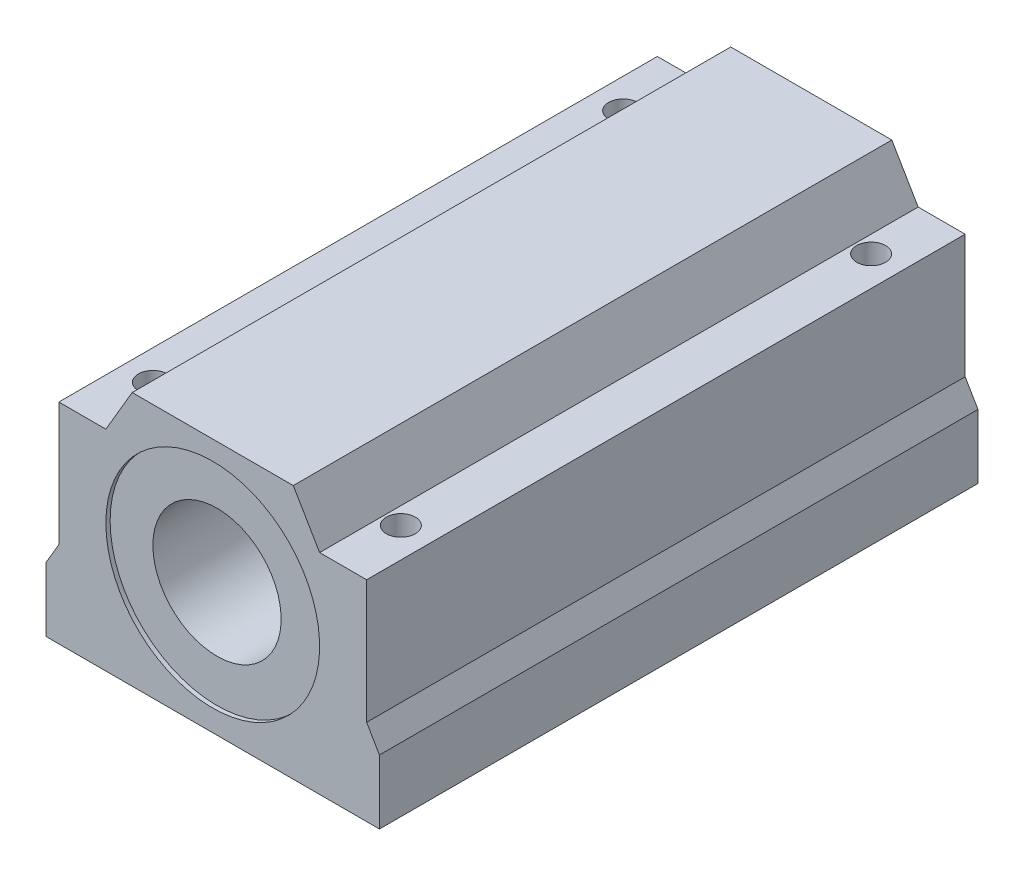
ISO-10303-21;
HEADER;
FILE_DESCRIPTION(('STEP AP214'),'2;1');
FILE_NAME('part.step','',(''),(''),'','','');
FILE_SCHEMA(('AUTOMOTIVE_DESIGN { 1 0 10303 214 1 1 1 1 }'));
ENDSEC;
DATA;
#1=APPLICATION_CONTEXT('core data for automotive mechanical design processes');
#2=APPLICATION_PROTOCOL_DEFINITION('international standard','automotive_design',2000,#1);
#3=PRODUCT_CONTEXT('',#1,'mechanical');
#4=PRODUCT('Part','Part','',(#3));
#5=PRODUCT_RELATED_PRODUCT_CATEGORY('part','',(#4));
#6=PRODUCT_DEFINITION_FORMATION('','',#4);
#7=PRODUCT_DEFINITION_CONTEXT('part definition',#1,'design');
#8=PRODUCT_DEFINITION('design','',#6,#7);
#9=PRODUCT_DEFINITION_SHAPE('','',#8);
#10=(LENGTH_UNIT() NAMED_UNIT(*) SI_UNIT(.MILLI.,.METRE.));
#11=(NAMED_UNIT(*) PLANE_ANGLE_UNIT() SI_UNIT($,.RADIAN.));
#12=(NAMED_UNIT(*) SI_UNIT($,.STERADIAN.) SOLID_ANGLE_UNIT());
#13=UNCERTAINTY_MEASURE_WITH_UNIT(LENGTH_MEASURE(1.E-05),#10,'distance_accuracy_value','');
#14=(GEOMETRIC_REPRESENTATION_CONTEXT(3) GLOBAL_UNCERTAINTY_ASSIGNED_CONTEXT((#13)) GLOBAL_UNIT_ASSIGNED_CONTEXT((#10,
#11,#12)) REPRESENTATION_CONTEXT('',''));
#15=CARTESIAN_POINT('',(0.,0.,0.));
#16=DIRECTION('',(0.,0.,1.));
#17=DIRECTION('',(1.,0.,0.));
#18=AXIS2_PLACEMENT_3D('',#15,#16,#17);
#19=CARTESIAN_POINT('',(0.,29.7500000000005,70.));
#20=DIRECTION('',(0.,0.,1.));
#21=DIRECTION('',(1.,0.,0.));
#22=AXIS2_PLACEMENT_3D('',#19,#20,#21);
#23=PLANE('',#22);
#24=CARTESIAN_POINT('',(0.,30.,70.));
#25=DIRECTION('',(0.,0.,-1.));
#26=DIRECTION('',(1.,0.,0.));
#27=AXIS2_PLACEMENT_3D('',#24,#25,#26);
#28=CIRCLE('',#27,25.);
#29=CARTESIAN_POINT('',(-25.,30.,70.));
#30=VERTEX_POINT('',#29);
#31=EDGE_CURVE('P0_E192',#30,#30,#28,.T.);
#32=ORIENTED_EDGE('',*,*,#31,.T.);
#33=EDGE_LOOP('',(#32));
#34=FACE_BOUND('',#33,.T.);
#35=DIRECTION('',(1.,0.,0.));
#36=VECTOR('',#35,1.);
#37=CARTESIAN_POINT('',(0.,0.,70.));
#38=LINE('',#37,#36);
#39=CARTESIAN_POINT('',(-39.,0.,70.));
#40=VERTEX_POINT('',#39);
#41=CARTESIAN_POINT('',(39.,0.,70.));
#42=VERTEX_POINT('',#41);
#43=EDGE_CURVE('P0_E11',#40,#42,#38,.T.);
#44=ORIENTED_EDGE('',*,*,#43,.T.);
#45=DIRECTION('',(0.,1.,0.));
#46=VECTOR('',#45,1.);
#47=CARTESIAN_POINT('',(39.,0.,70.));
#48=LINE('',#47,#46);
#49=CARTESIAN_POINT('',(39.,15.,70.));
#50=VERTEX_POINT('',#49);
#51=EDGE_CURVE('P0_E261',#42,#50,#48,.T.);
#52=ORIENTED_EDGE('',*,*,#51,.T.);
#53=DIRECTION('',(-0.505858736644665,0.862616333348879,0.));
#54=VECTOR('',#53,1.);
#55=CARTESIAN_POINT('',(36.,20.1157542858934,70.));
#56=LINE('',#55,#54);
#57=CARTESIAN_POINT('',(36.,20.1157542858934,70.));
#58=VERTEX_POINT('',#57);
#59=EDGE_CURVE('P0_E282',#50,#58,#56,.T.);
#60=ORIENTED_EDGE('',*,*,#59,.T.);
#61=DIRECTION('',(0.,1.,0.));
#62=VECTOR('',#61,1.);
#63=CARTESIAN_POINT('',(36.,20.1157542858934,70.));
#64=LINE('',#63,#62);
#65=CARTESIAN_POINT('',(36.,49.,70.));
#66=VERTEX_POINT('',#65);
#67=EDGE_CURVE('P0_E230',#58,#66,#64,.T.);
#68=ORIENTED_EDGE('',*,*,#67,.T.);
#69=DIRECTION('',(-1.,0.,0.));
#70=VECTOR('',#69,1.);
#71=CARTESIAN_POINT('',(36.,49.,70.));
#72=LINE('',#71,#70);
#73=CARTESIAN_POINT('',(25.,49.,70.));
#74=VERTEX_POINT('',#73);
#75=EDGE_CURVE('P0_E335',#66,#74,#72,.T.);
#76=ORIENTED_EDGE('',*,*,#75,.T.);
#77=DIRECTION('',(-0.505858736644659,0.862616333348882,0.));
#78=VECTOR('',#77,1.);
#79=CARTESIAN_POINT('',(18.8425502399788,59.5000000000011,70.));
#80=LINE('',#79,#78);
#81=CARTESIAN_POINT('',(18.8425502399788,59.5,70.));
#82=VERTEX_POINT('',#81);
#83=EDGE_CURVE('P0_E344',#74,#82,#80,.T.);
#84=ORIENTED_EDGE('',*,*,#83,.T.);
#85=DIRECTION('',(-1.,0.,0.));
#86=VECTOR('',#85,1.);
#87=CARTESIAN_POINT('',(0.,59.5,70.));
#88=LINE('',#87,#86);
#89=CARTESIAN_POINT('',(-18.8425502399788,59.5000000000009,70.));
#90=VERTEX_POINT('',#89);
#91=EDGE_CURVE('P0_E287',#82,#90,#88,.T.);
#92=ORIENTED_EDGE('',*,*,#91,.T.);
#93=DIRECTION('',(-0.505858736644664,-0.862616333348879,0.));
#94=VECTOR('',#93,1.);
#95=CARTESIAN_POINT('',(-25.,49.,70.));
#96=LINE('',#95,#94);
#97=CARTESIAN_POINT('',(-25.,49.,70.));
#98=VERTEX_POINT('',#97);
#99=EDGE_CURVE('P0_E275',#90,#98,#96,.T.);
#100=ORIENTED_EDGE('',*,*,#99,.T.);
#101=DIRECTION('',(-1.,0.,0.));
#102=VECTOR('',#101,1.);
#103=CARTESIAN_POINT('',(-36.,49.,70.));
#104=LINE('',#103,#102);
#105=CARTESIAN_POINT('',(-36.,49.,70.));
#106=VERTEX_POINT('',#105);
#107=EDGE_CURVE('P0_E276',#98,#106,#104,.T.);
#108=ORIENTED_EDGE('',*,*,#107,.T.);
#109=DIRECTION('',(0.,-1.,0.));
#110=VECTOR('',#109,1.);
#111=CARTESIAN_POINT('',(-36.,20.1157542858934,70.));
#112=LINE('',#111,#110);
#113=CARTESIAN_POINT('',(-36.,20.1157542858934,70.));
#114=VERTEX_POINT('',#113);
#115=EDGE_CURVE('P0_E291',#106,#114,#112,.T.);
#116=ORIENTED_EDGE('',*,*,#115,.T.);
#117=DIRECTION('',(-0.505858736644665,-0.862616333348879,0.));
#118=VECTOR('',#117,1.);
#119=CARTESIAN_POINT('',(-39.,15.,70.));
#120=LINE('',#119,#118);
#121=CARTESIAN_POINT('',(-39.,15.,70.));
#122=VERTEX_POINT('',#121);
#123=EDGE_CURVE('P0_E226',#114,#122,#120,.T.);
#124=ORIENTED_EDGE('',*,*,#123,.T.);
#125=DIRECTION('',(0.,-1.,0.));
#126=VECTOR('',#125,1.);
#127=CARTESIAN_POINT('',(-39.,0.,70.));
#128=LINE('',#127,#126);
#129=EDGE_CURVE('P0_E247',#122,#40,#128,.T.);
#130=ORIENTED_EDGE('',*,*,#129,.T.);
#131=EDGE_LOOP('',(#44,#52,#60,#68,#76,#84,#92,#100,#108,#116,#124,#130));
#132=FACE_BOUND('',#131,.T.);
#133=ADVANCED_FACE('P0_F16',(#34,#132),#23,.T.);
#134=CARTESIAN_POINT('',(-39.,0.,0.));
#135=DIRECTION('',(0.,-1.,0.));
#136=DIRECTION('',(0.,0.,-1.));
#137=AXIS2_PLACEMENT_3D('',#134,#135,#136);
#138=PLANE('',#137);
#139=CARTESIAN_POINT('',(-29.,0.,-55.));
#140=DIRECTION('',(0.,1.,0.));
#141=DIRECTION('',(0.,0.,-1.));
#142=AXIS2_PLACEMENT_3D('',#139,#140,#141);
#143=CIRCLE('',#142,3.38975);
#144=CARTESIAN_POINT('',(-29.,0.,-51.61025));
#145=VERTEX_POINT('',#144);
#146=EDGE_CURVE('P0_E240',#145,#145,#143,.T.);
#147=ORIENTED_EDGE('',*,*,#146,.T.);
#148=EDGE_LOOP('',(#147));
#149=FACE_BOUND('',#148,.T.);
#150=CARTESIAN_POINT('',(29.,0.,55.));
#151=DIRECTION('',(0.,1.,0.));
#152=DIRECTION('',(0.,0.,-1.));
#153=AXIS2_PLACEMENT_3D('',#150,#151,#152);
#154=CIRCLE('',#153,3.38975);
#155=CARTESIAN_POINT('',(29.,0.,58.38975));
#156=VERTEX_POINT('',#155);
#157=EDGE_CURVE('P0_E214',#156,#156,#154,.T.);
#158=ORIENTED_EDGE('',*,*,#157,.T.);
#159=EDGE_LOOP('',(#158));
#160=FACE_BOUND('',#159,.T.);
#161=CARTESIAN_POINT('',(-29.,0.,55.));
#162=DIRECTION('',(0.,1.,0.));
#163=DIRECTION('',(0.,0.,-1.));
#164=AXIS2_PLACEMENT_3D('',#161,#162,#163);
#165=CIRCLE('',#164,3.38975);
#166=CARTESIAN_POINT('',(-29.,0.,58.38975));
#167=VERTEX_POINT('',#166);
#168=EDGE_CURVE('P0_E295',#167,#167,#165,.T.);
#169=ORIENTED_EDGE('',*,*,#168,.T.);
#170=EDGE_LOOP('',(#169));
#171=FACE_BOUND('',#170,.T.);
#172=CARTESIAN_POINT('',(29.,0.,-55.));
#173=DIRECTION('',(0.,1.,0.));
#174=DIRECTION('',(0.,0.,-1.));
#175=AXIS2_PLACEMENT_3D('',#172,#173,#174);
#176=CIRCLE('',#175,3.38975);
#177=CARTESIAN_POINT('',(29.,0.,-51.61025));
#178=VERTEX_POINT('',#177);
#179=EDGE_CURVE('P0_E290',#178,#178,#176,.T.);
#180=ORIENTED_EDGE('',*,*,#179,.T.);
#181=EDGE_LOOP('',(#180));
#182=FACE_BOUND('',#181,.T.);
#183=DIRECTION('',(0.,0.,1.));
#184=VECTOR('',#183,1.);
#185=CARTESIAN_POINT('',(39.,0.,0.));
#186=LINE('',#185,#184);
#187=CARTESIAN_POINT('',(39.,0.,-70.));
#188=VERTEX_POINT('',#187);
#189=EDGE_CURVE('P0_E27',#188,#42,#186,.T.);
#190=ORIENTED_EDGE('',*,*,#189,.T.);
#191=ORIENTED_EDGE('',*,*,#43,.F.);
#192=DIRECTION('',(0.,0.,1.));
#193=VECTOR('',#192,1.);
#194=CARTESIAN_POINT('',(-39.,0.,0.));
#195=LINE('',#194,#193);
#196=CARTESIAN_POINT('',(-39.,0.,-70.));
#197=VERTEX_POINT('',#196);
#198=EDGE_CURVE('P0_E175',#197,#40,#195,.T.);
#199=ORIENTED_EDGE('',*,*,#198,.F.);
#200=DIRECTION('',(-1.,0.,0.));
#201=VECTOR('',#200,1.);
#202=CARTESIAN_POINT('',(0.,0.,-70.));
#203=LINE('',#202,#201);
#204=EDGE_CURVE('P0_E267',#188,#197,#203,.T.);
#205=ORIENTED_EDGE('',*,*,#204,.F.);
#206=EDGE_LOOP('',(#190,#191,#199,#205));
#207=FACE_BOUND('',#206,.T.);
#208=ADVANCED_FACE('P0_F310',(#149,#160,#171,#182,#207),#138,.T.);
#209=CARTESIAN_POINT('',(39.,0.,0.));
#210=DIRECTION('',(1.,0.,0.));
#211=DIRECTION('',(0.,1.,0.));
#212=AXIS2_PLACEMENT_3D('',#209,#210,#211);
#213=PLANE('',#212);
#214=DIRECTION('',(0.,0.,1.));
#215=VECTOR('',#214,1.);
#216=CARTESIAN_POINT('',(39.,15.,0.));
#217=LINE('',#216,#215);
#218=CARTESIAN_POINT('',(39.,15.,-70.));
#219=VERTEX_POINT('',#218);
#220=EDGE_CURVE('P0_E264',#219,#50,#217,.T.);
#221=ORIENTED_EDGE('',*,*,#220,.T.);
#222=ORIENTED_EDGE('',*,*,#51,.F.);
#223=ORIENTED_EDGE('',*,*,#189,.F.);
#224=DIRECTION('',(0.,-1.,0.));
#225=VECTOR('',#224,1.);
#226=CARTESIAN_POINT('',(39.,0.,-70.));
#227=LINE('',#226,#225);
#228=EDGE_CURVE('P0_E199',#219,#188,#227,.T.);
#229=ORIENTED_EDGE('',*,*,#228,.F.);
#230=EDGE_LOOP('',(#221,#222,#223,#229));
#231=FACE_BOUND('',#230,.T.);
#232=ADVANCED_FACE('P0_F314',(#231),#213,.T.);
#233=CARTESIAN_POINT('',(39.,15.,0.));
#234=DIRECTION('',(0.862616333348879,0.505858736644664,0.));
#235=DIRECTION('',(0.,0.,-1.));
#236=AXIS2_PLACEMENT_3D('',#233,#234,#235);
#237=PLANE('',#236);
#238=DIRECTION('',(0.,0.,1.));
#239=VECTOR('',#238,1.);
#240=CARTESIAN_POINT('',(36.,20.1157542858934,0.));
#241=LINE('',#240,#239);
#242=CARTESIAN_POINT('',(36.,20.1157542858934,-70.));
#243=VERTEX_POINT('',#242);
#244=EDGE_CURVE('P0_E233',#243,#58,#241,.T.);
#245=ORIENTED_EDGE('',*,*,#244,.T.);
#246=ORIENTED_EDGE('',*,*,#59,.F.);
#247=ORIENTED_EDGE('',*,*,#220,.F.);
#248=DIRECTION('',(0.505858736644665,-0.862616333348879,0.));
#249=VECTOR('',#248,1.);
#250=CARTESIAN_POINT('',(36.,20.1157542858934,-70.));
#251=LINE('',#250,#249);
#252=EDGE_CURVE('P0_E208',#243,#219,#251,.T.);
#253=ORIENTED_EDGE('',*,*,#252,.F.);
#254=EDGE_LOOP('',(#245,#246,#247,#253));
#255=FACE_BOUND('',#254,.T.);
#256=ADVANCED_FACE('P0_F323',(#255),#237,.T.);
#257=CARTESIAN_POINT('',(36.,20.1157542858934,0.));
#258=DIRECTION('',(1.,0.,0.));
#259=DIRECTION('',(0.,-1.,0.));
#260=AXIS2_PLACEMENT_3D('',#257,#258,#259);
#261=PLANE('',#260);
#262=DIRECTION('',(0.,0.,1.));
#263=VECTOR('',#262,1.);
#264=CARTESIAN_POINT('',(36.,49.,0.));
#265=LINE('',#264,#263);
#266=CARTESIAN_POINT('',(36.,49.,-70.));
#267=VERTEX_POINT('',#266);
#268=EDGE_CURVE('P0_E234',#267,#66,#265,.T.);
#269=ORIENTED_EDGE('',*,*,#268,.T.);
#270=ORIENTED_EDGE('',*,*,#67,.F.);
#271=ORIENTED_EDGE('',*,*,#244,.F.);
#272=DIRECTION('',(0.,-1.,0.));
#273=VECTOR('',#272,1.);
#274=CARTESIAN_POINT('',(36.,20.1157542858934,-70.));
#275=LINE('',#274,#273);
#276=EDGE_CURVE('P0_E302',#267,#243,#275,.T.);
#277=ORIENTED_EDGE('',*,*,#276,.F.);
#278=EDGE_LOOP('',(#269,#270,#271,#277));
#279=FACE_BOUND('',#278,.T.);
#280=ADVANCED_FACE('P0_F329',(#279),#261,.T.);
#281=CARTESIAN_POINT('',(36.,49.,0.));
#282=DIRECTION('',(0.,1.,0.));
#283=DIRECTION('',(1.,0.,0.));
#284=AXIS2_PLACEMENT_3D('',#281,#282,#283);
#285=PLANE('',#284);
#286=CARTESIAN_POINT('',(29.,49.,55.));
#287=DIRECTION('',(0.,-1.,0.));
#288=DIRECTION('',(0.,0.,-1.));
#289=AXIS2_PLACEMENT_3D('',#286,#287,#288);
#290=CIRCLE('',#289,3.38975);
#291=CARTESIAN_POINT('',(29.,49.,58.38975));
#292=VERTEX_POINT('',#291);
#293=EDGE_CURVE('P0_E241',#292,#292,#290,.T.);
#294=ORIENTED_EDGE('',*,*,#293,.T.);
#295=EDGE_LOOP('',(#294));
#296=FACE_BOUND('',#295,.T.);
#297=CARTESIAN_POINT('',(29.,49.,-55.));
#298=DIRECTION('',(0.,-1.,0.));
#299=DIRECTION('',(0.,0.,-1.));
#300=AXIS2_PLACEMENT_3D('',#297,#298,#299);
#301=CIRCLE('',#300,3.38975);
#302=CARTESIAN_POINT('',(29.,49.,-51.61025));
#303=VERTEX_POINT('',#302);
#304=EDGE_CURVE('P0_E61',#303,#303,#301,.T.);
#305=ORIENTED_EDGE('',*,*,#304,.T.);
#306=EDGE_LOOP('',(#305));
#307=FACE_BOUND('',#306,.T.);
#308=DIRECTION('',(0.,0.,1.));
#309=VECTOR('',#308,1.);
#310=CARTESIAN_POINT('',(25.,49.,0.));
#311=LINE('',#310,#309);
#312=CARTESIAN_POINT('',(25.,49.,-70.));
#313=VERTEX_POINT('',#312);
#314=EDGE_CURVE('P0_E212',#313,#74,#311,.T.);
#315=ORIENTED_EDGE('',*,*,#314,.T.);
#316=ORIENTED_EDGE('',*,*,#75,.F.);
#317=ORIENTED_EDGE('',*,*,#268,.F.);
#318=DIRECTION('',(1.,0.,0.));
#319=VECTOR('',#318,1.);
#320=CARTESIAN_POINT('',(36.,49.,-70.));
#321=LINE('',#320,#319);
#322=EDGE_CURVE('P0_E224',#313,#267,#321,.T.);
#323=ORIENTED_EDGE('',*,*,#322,.F.);
#324=EDGE_LOOP('',(#315,#316,#317,#323));
#325=FACE_BOUND('',#324,.T.);
#326=ADVANCED_FACE('P0_F337',(#296,#307,#325),#285,.T.);
#327=CARTESIAN_POINT('',(25.,49.,0.));
#328=DIRECTION('',(0.862616333348882,0.505858736644659,0.));
#329=DIRECTION('',(0.,0.,-1.));
#330=AXIS2_PLACEMENT_3D('',#327,#328,#329);
#331=PLANE('',#330);
#332=DIRECTION('',(0.,0.,1.));
#333=VECTOR('',#332,1.);
#334=CARTESIAN_POINT('',(18.8425502399788,59.5,0.));
#335=LINE('',#334,#333);
#336=CARTESIAN_POINT('',(18.8425502399788,59.5,-70.));
#337=VERTEX_POINT('',#336);
#338=EDGE_CURVE('P0_E348',#337,#82,#335,.T.);
#339=ORIENTED_EDGE('',*,*,#338,.T.);
#340=ORIENTED_EDGE('',*,*,#83,.F.);
#341=ORIENTED_EDGE('',*,*,#314,.F.);
#342=DIRECTION('',(0.505858736644659,-0.862616333348882,0.));
#343=VECTOR('',#342,1.);
#344=CARTESIAN_POINT('',(18.8425502399788,59.5000000000011,-70.));
#345=LINE('',#344,#343);
#346=EDGE_CURVE('P0_E220',#337,#313,#345,.T.);
#347=ORIENTED_EDGE('',*,*,#346,.F.);
#348=EDGE_LOOP('',(#339,#340,#341,#347));
#349=FACE_BOUND('',#348,.T.);
#350=ADVANCED_FACE('P0_F381',(#349),#331,.T.);
#351=CARTESIAN_POINT('',(18.8425502399788,59.5,0.));
#352=DIRECTION('',(0.,1.,0.));
#353=DIRECTION('',(1.,0.,0.));
#354=AXIS2_PLACEMENT_3D('',#351,#352,#353);
#355=PLANE('',#354);
#356=DIRECTION('',(0.,0.,1.));
#357=VECTOR('',#356,1.);
#358=CARTESIAN_POINT('',(-18.8425502399788,59.5000000000009,0.));
#359=LINE('',#358,#357);
#360=CARTESIAN_POINT('',(-18.8425502399788,59.5000000000009,-70.));
#361=VERTEX_POINT('',#360);
#362=EDGE_CURVE('P0_E283',#361,#90,#359,.T.);
#363=ORIENTED_EDGE('',*,*,#362,.T.);
#364=ORIENTED_EDGE('',*,*,#91,.F.);
#365=ORIENTED_EDGE('',*,*,#338,.F.);
#366=DIRECTION('',(1.,0.,0.));
#367=VECTOR('',#366,1.);
#368=CARTESIAN_POINT('',(0.,59.5,-70.));
#369=LINE('',#368,#367);
#370=EDGE_CURVE('P0_E225',#361,#337,#369,.T.);
#371=ORIENTED_EDGE('',*,*,#370,.F.);
#372=EDGE_LOOP('',(#363,#364,#365,#371));
#373=FACE_BOUND('',#372,.T.);
#374=ADVANCED_FACE('P0_F18',(#373),#355,.T.);
#375=CARTESIAN_POINT('',(-18.8425502399788,59.5000000000009,0.));
#376=DIRECTION('',(-0.862616333348879,0.505858736644664,0.));
#377=DIRECTION('',(0.,0.,1.));
#378=AXIS2_PLACEMENT_3D('',#375,#376,#377);
#379=PLANE('',#378);
#380=DIRECTION('',(0.,0.,1.));
#381=VECTOR('',#380,1.);
#382=CARTESIAN_POINT('',(-25.,49.,0.));
#383=LINE('',#382,#381);
#384=CARTESIAN_POINT('',(-25.,49.,-70.));
#385=VERTEX_POINT('',#384);
#386=EDGE_CURVE('P0_E271',#385,#98,#383,.T.);
#387=ORIENTED_EDGE('',*,*,#386,.T.);
#388=ORIENTED_EDGE('',*,*,#99,.F.);
#389=ORIENTED_EDGE('',*,*,#362,.F.);
#390=DIRECTION('',(0.505858736644664,0.862616333348879,0.));
#391=VECTOR('',#390,1.);
#392=CARTESIAN_POINT('',(-25.,49.,-70.));
#393=LINE('',#392,#391);
#394=EDGE_CURVE('P0_E257',#385,#361,#393,.T.);
#395=ORIENTED_EDGE('',*,*,#394,.F.);
#396=EDGE_LOOP('',(#387,#388,#389,#395));
#397=FACE_BOUND('',#396,.T.);
#398=ADVANCED_FACE('P0_F374',(#397),#379,.T.);
#399=CARTESIAN_POINT('',(-25.,49.,0.));
#400=DIRECTION('',(0.,1.,0.));
#401=DIRECTION('',(1.,0.,0.));
#402=AXIS2_PLACEMENT_3D('',#399,#400,#401);
#403=PLANE('',#402);
#404=CARTESIAN_POINT('',(-29.,49.,-55.));
#405=DIRECTION('',(0.,-1.,0.));
#406=DIRECTION('',(0.,0.,-1.));
#407=AXIS2_PLACEMENT_3D('',#404,#405,#406);
#408=CIRCLE('',#407,3.38975);
#409=CARTESIAN_POINT('',(-29.,49.,-51.61025));
#410=VERTEX_POINT('',#409);
#411=EDGE_CURVE('P0_E239',#410,#410,#408,.T.);
#412=ORIENTED_EDGE('',*,*,#411,.T.);
#413=EDGE_LOOP('',(#412));
#414=FACE_BOUND('',#413,.T.);
#415=CARTESIAN_POINT('',(-29.,49.,55.));
#416=DIRECTION('',(0.,-1.,0.));
#417=DIRECTION('',(0.,0.,-1.));
#418=AXIS2_PLACEMENT_3D('',#415,#416,#417);
#419=CIRCLE('',#418,3.38975);
#420=CARTESIAN_POINT('',(-29.,49.,58.38975));
#421=VERTEX_POINT('',#420);
#422=EDGE_CURVE('P0_E219',#421,#421,#419,.T.);
#423=ORIENTED_EDGE('',*,*,#422,.T.);
#424=EDGE_LOOP('',(#423));
#425=FACE_BOUND('',#424,.T.);
#426=DIRECTION('',(0.,0.,1.));
#427=VECTOR('',#426,1.);
#428=CARTESIAN_POINT('',(-36.,49.,0.));
#429=LINE('',#428,#427);
#430=CARTESIAN_POINT('',(-36.,49.,-70.));
#431=VERTEX_POINT('',#430);
#432=EDGE_CURVE('P0_E294',#431,#106,#429,.T.);
#433=ORIENTED_EDGE('',*,*,#432,.T.);
#434=ORIENTED_EDGE('',*,*,#107,.F.);
#435=ORIENTED_EDGE('',*,*,#386,.F.);
#436=DIRECTION('',(1.,0.,0.));
#437=VECTOR('',#436,1.);
#438=CARTESIAN_POINT('',(-36.,49.,-70.));
#439=LINE('',#438,#437);
#440=EDGE_CURVE('P0_E253',#431,#385,#439,.T.);
#441=ORIENTED_EDGE('',*,*,#440,.F.);
#442=EDGE_LOOP('',(#433,#434,#435,#441));
#443=FACE_BOUND('',#442,.T.);
#444=ADVANCED_FACE('P0_F407',(#414,#425,#443),#403,.T.);
#445=CARTESIAN_POINT('',(-36.,49.,0.));
#446=DIRECTION('',(-1.,0.,0.));
#447=DIRECTION('',(0.,1.,0.));
#448=AXIS2_PLACEMENT_3D('',#445,#446,#447);
#449=PLANE('',#448);
#450=DIRECTION('',(0.,0.,1.));
#451=VECTOR('',#450,1.);
#452=CARTESIAN_POINT('',(-36.,20.1157542858934,0.));
#453=LINE('',#452,#451);
#454=CARTESIAN_POINT('',(-36.,20.1157542858934,-70.));
#455=VERTEX_POINT('',#454);
#456=EDGE_CURVE('P0_E157',#455,#114,#453,.T.);
#457=ORIENTED_EDGE('',*,*,#456,.T.);
#458=ORIENTED_EDGE('',*,*,#115,.F.);
#459=ORIENTED_EDGE('',*,*,#432,.F.);
#460=DIRECTION('',(0.,1.,0.));
#461=VECTOR('',#460,1.);
#462=CARTESIAN_POINT('',(-36.,20.1157542858934,-70.));
#463=LINE('',#462,#461);
#464=EDGE_CURVE('P0_E20',#455,#431,#463,.T.);
#465=ORIENTED_EDGE('',*,*,#464,.F.);
#466=EDGE_LOOP('',(#457,#458,#459,#465));
#467=FACE_BOUND('',#466,.T.);
#468=ADVANCED_FACE('P0_F409',(#467),#449,.T.);
#469=CARTESIAN_POINT('',(-36.,20.1157542858934,0.));
#470=DIRECTION('',(-0.862616333348879,0.505858736644665,0.));
#471=DIRECTION('',(0.,0.,1.));
#472=AXIS2_PLACEMENT_3D('',#469,#470,#471);
#473=PLANE('',#472);
#474=DIRECTION('',(0.,0.,1.));
#475=VECTOR('',#474,1.);
#476=CARTESIAN_POINT('',(-39.,15.,0.));
#477=LINE('',#476,#475);
#478=CARTESIAN_POINT('',(-39.,15.,-70.));
#479=VERTEX_POINT('',#478);
#480=EDGE_CURVE('P0_E166',#479,#122,#477,.T.);
#481=ORIENTED_EDGE('',*,*,#480,.T.);
#482=ORIENTED_EDGE('',*,*,#123,.F.);
#483=ORIENTED_EDGE('',*,*,#456,.F.);
#484=DIRECTION('',(0.505858736644665,0.862616333348879,0.));
#485=VECTOR('',#484,1.);
#486=CARTESIAN_POINT('',(-39.,15.,-70.));
#487=LINE('',#486,#485);
#488=EDGE_CURVE('P0_E248',#479,#455,#487,.T.);
#489=ORIENTED_EDGE('',*,*,#488,.F.);
#490=EDGE_LOOP('',(#481,#482,#483,#489));
#491=FACE_BOUND('',#490,.T.);
#492=ADVANCED_FACE('P0_F414',(#491),#473,.T.);
#493=CARTESIAN_POINT('',(-39.,15.,0.));
#494=DIRECTION('',(-1.,0.,0.));
#495=DIRECTION('',(0.,0.,1.));
#496=AXIS2_PLACEMENT_3D('',#493,#494,#495);
#497=PLANE('',#496);
#498=ORIENTED_EDGE('',*,*,#198,.T.);
#499=ORIENTED_EDGE('',*,*,#129,.F.);
#500=ORIENTED_EDGE('',*,*,#480,.F.);
#501=DIRECTION('',(0.,1.,0.));
#502=VECTOR('',#501,1.);
#503=CARTESIAN_POINT('',(-39.,0.,-70.));
#504=LINE('',#503,#502);
#505=EDGE_CURVE('P0_E252',#197,#479,#504,.T.);
#506=ORIENTED_EDGE('',*,*,#505,.F.);
#507=EDGE_LOOP('',(#498,#499,#500,#506));
#508=FACE_BOUND('',#507,.T.);
#509=ADVANCED_FACE('P0_F416',(#508),#497,.T.);
#510=CARTESIAN_POINT('',(0.,30.,0.));
#511=DIRECTION('',(0.,0.,1.));
#512=DIRECTION('',(1.,0.,0.));
#513=AXIS2_PLACEMENT_3D('',#510,#511,#512);
#514=CYLINDRICAL_SURFACE('',#513,25.);
#515=ORIENTED_EDGE('',*,*,#31,.F.);
#516=DIRECTION('',(0.,0.,-1.));
#517=VECTOR('',#516,1.);
#518=CARTESIAN_POINT('',(-25.,30.,0.));
#519=LINE('',#518,#517);
#520=CARTESIAN_POINT('',(-25.,30.,-70.));
#521=VERTEX_POINT('',#520);
#522=EDGE_CURVE('P0_E187',#30,#521,#519,.T.);
#523=ORIENTED_EDGE('',*,*,#522,.T.);
#524=CARTESIAN_POINT('',(0.,30.,-70.));
#525=DIRECTION('',(0.,0.,1.));
#526=DIRECTION('',(1.,0.,0.));
#527=AXIS2_PLACEMENT_3D('',#524,#525,#526);
#528=CIRCLE('',#527,25.);
#529=EDGE_CURVE('P0_E190',#521,#521,#528,.T.);
#530=ORIENTED_EDGE('',*,*,#529,.F.);
#531=ORIENTED_EDGE('',*,*,#522,.F.);
#532=EDGE_LOOP('',(#515,#523,#530,#531));
#533=FACE_BOUND('',#532,.T.);
#534=ADVANCED_FACE('P0_F189',(#533),#514,.F.);
#535=CARTESIAN_POINT('',(0.,29.7500000000005,-70.));
#536=DIRECTION('',(0.,0.,1.));
#537=DIRECTION('',(1.,0.,0.));
#538=AXIS2_PLACEMENT_3D('',#535,#536,#537);
#539=PLANE('',#538);
#540=ORIENTED_EDGE('',*,*,#529,.T.);
#541=EDGE_LOOP('',(#540));
#542=FACE_BOUND('',#541,.T.);
#543=ORIENTED_EDGE('',*,*,#204,.T.);
#544=ORIENTED_EDGE('',*,*,#505,.T.);
#545=ORIENTED_EDGE('',*,*,#488,.T.);
#546=ORIENTED_EDGE('',*,*,#464,.T.);
#547=ORIENTED_EDGE('',*,*,#440,.T.);
#548=ORIENTED_EDGE('',*,*,#394,.T.);
#549=ORIENTED_EDGE('',*,*,#370,.T.);
#550=ORIENTED_EDGE('',*,*,#346,.T.);
#551=ORIENTED_EDGE('',*,*,#322,.T.);
#552=ORIENTED_EDGE('',*,*,#276,.T.);
#553=ORIENTED_EDGE('',*,*,#252,.T.);
#554=ORIENTED_EDGE('',*,*,#228,.T.);
#555=EDGE_LOOP('',(#543,#544,#545,#546,#547,#548,#549,#550,#551,#552,#553,#554));
#556=FACE_BOUND('',#555,.T.);
#557=ADVANCED_FACE('P0_F196',(#542,#556),#539,.F.);
#558=CARTESIAN_POINT('',(-29.,26.95,-55.));
#559=DIRECTION('',(0.,1.,0.));
#560=DIRECTION('',(0.,0.,-1.));
#561=AXIS2_PLACEMENT_3D('',#558,#559,#560);
#562=CYLINDRICAL_SURFACE('',#561,3.38975);
#563=ORIENTED_EDGE('',*,*,#146,.F.);
#564=DIRECTION('',(0.,1.,0.));
#565=VECTOR('',#564,1.);
#566=CARTESIAN_POINT('',(-29.,26.95,-51.61025));
#567=LINE('',#566,#565);
#568=EDGE_CURVE('P0_E235',#145,#410,#567,.T.);
#569=ORIENTED_EDGE('',*,*,#568,.T.);
#570=ORIENTED_EDGE('',*,*,#411,.F.);
#571=ORIENTED_EDGE('',*,*,#568,.F.);
#572=EDGE_LOOP('',(#563,#569,#570,#571));
#573=FACE_BOUND('',#572,.T.);
#574=ADVANCED_FACE('P0_F503',(#573),#562,.F.);
#575=CARTESIAN_POINT('',(29.,26.95,55.));
#576=DIRECTION('',(0.,1.,0.));
#577=DIRECTION('',(0.,0.,-1.));
#578=AXIS2_PLACEMENT_3D('',#575,#576,#577);
#579=CYLINDRICAL_SURFACE('',#578,3.38975);
#580=ORIENTED_EDGE('',*,*,#157,.F.);
#581=DIRECTION('',(0.,1.,0.));
#582=VECTOR('',#581,1.);
#583=CARTESIAN_POINT('',(29.,26.95,58.38975));
#584=LINE('',#583,#582);
#585=EDGE_CURVE('P0_E218',#156,#292,#584,.T.);
#586=ORIENTED_EDGE('',*,*,#585,.T.);
#587=ORIENTED_EDGE('',*,*,#293,.F.);
#588=ORIENTED_EDGE('',*,*,#585,.F.);
#589=EDGE_LOOP('',(#580,#586,#587,#588));
#590=FACE_BOUND('',#589,.T.);
#591=ADVANCED_FACE('P0_F513',(#590),#579,.F.);
#592=CARTESIAN_POINT('',(-29.,26.95,55.));
#593=DIRECTION('',(0.,1.,0.));
#594=DIRECTION('',(0.,0.,-1.));
#595=AXIS2_PLACEMENT_3D('',#592,#593,#594);
#596=CYLINDRICAL_SURFACE('',#595,3.38975);
#597=ORIENTED_EDGE('',*,*,#168,.F.);
#598=DIRECTION('',(0.,1.,0.));
#599=VECTOR('',#598,1.);
#600=CARTESIAN_POINT('',(-29.,26.95,58.38975));
#601=LINE('',#600,#599);
#602=EDGE_CURVE('P0_E260',#167,#421,#601,.T.);
#603=ORIENTED_EDGE('',*,*,#602,.T.);
#604=ORIENTED_EDGE('',*,*,#422,.F.);
#605=ORIENTED_EDGE('',*,*,#602,.F.);
#606=EDGE_LOOP('',(#597,#603,#604,#605));
#607=FACE_BOUND('',#606,.T.);
#608=ADVANCED_FACE('P0_F609',(#607),#596,.F.);
#609=CARTESIAN_POINT('',(29.,26.95,-55.));
#610=DIRECTION('',(0.,1.,0.));
#611=DIRECTION('',(0.,0.,-1.));
#612=AXIS2_PLACEMENT_3D('',#609,#610,#611);
#613=CYLINDRICAL_SURFACE('',#612,3.38975);
#614=ORIENTED_EDGE('',*,*,#179,.F.);
#615=DIRECTION('',(0.,1.,0.));
#616=VECTOR('',#615,1.);
#617=CARTESIAN_POINT('',(29.,26.95,-51.61025));
#618=LINE('',#617,#616);
#619=EDGE_CURVE('P0_E75',#178,#303,#618,.T.);
#620=ORIENTED_EDGE('',*,*,#619,.T.);
#621=ORIENTED_EDGE('',*,*,#304,.F.);
#622=ORIENTED_EDGE('',*,*,#619,.F.);
#623=EDGE_LOOP('',(#614,#620,#621,#622));
#624=FACE_BOUND('',#623,.T.);
#625=ADVANCED_FACE('P0_F635',(#624),#613,.F.);
#626=CLOSED_SHELL('',(#133,#208,#232,#256,#280,#326,#350,#374,#398,#444,#468,#492,#509,#534,
#557,#574,#591,#608,#625));
#627=MANIFOLD_SOLID_BREP('P0_B1',#626);
#628=CARTESIAN_POINT('',(0.,30.,69.));
#629=DIRECTION('',(0.,0.,1.));
#630=DIRECTION('',(1.,0.,0.));
#631=AXIS2_PLACEMENT_3D('',#628,#629,#630);
#632=PLANE('',#631);
#633=CARTESIAN_POINT('',(0.,30.,69.));
#634=DIRECTION('',(0.,0.,-1.));
#635=DIRECTION('',(1.,0.,0.));
#636=AXIS2_PLACEMENT_3D('',#633,#634,#635);
#637=CIRCLE('',#636,15.);
#638=CARTESIAN_POINT('',(-15.,30.,69.));
#639=VERTEX_POINT('',#638);
#640=EDGE_CURVE('P1_E65',#639,#639,#637,.T.);
#641=ORIENTED_EDGE('',*,*,#640,.T.);
#642=EDGE_LOOP('',(#641));
#643=FACE_BOUND('',#642,.T.);
#644=CARTESIAN_POINT('',(0.,30.,69.));
#645=DIRECTION('',(0.,0.,1.));
#646=DIRECTION('',(1.,0.,0.));
#647=AXIS2_PLACEMENT_3D('',#644,#645,#646);
#648=CIRCLE('',#647,25.);
#649=CARTESIAN_POINT('',(-25.,30.,69.));
#650=VERTEX_POINT('',#649);
#651=EDGE_CURVE('P1_E27',#650,#650,#648,.T.);
#652=ORIENTED_EDGE('',*,*,#651,.T.);
#653=EDGE_LOOP('',(#652));
#654=FACE_BOUND('',#653,.T.);
#655=ADVANCED_FACE('P1_F16',(#643,#654),#632,.T.);
#656=CARTESIAN_POINT('',(0.,30.,0.));
#657=DIRECTION('',(0.,0.,1.));
#658=DIRECTION('',(1.,0.,0.));
#659=AXIS2_PLACEMENT_3D('',#656,#657,#658);
#660=CYLINDRICAL_SURFACE('',#659,25.);
#661=ORIENTED_EDGE('',*,*,#651,.F.);
#662=DIRECTION('',(0.,0.,-1.));
#663=VECTOR('',#662,1.);
#664=CARTESIAN_POINT('',(-25.,30.,0.));
#665=LINE('',#664,#663);
#666=CARTESIAN_POINT('',(-25.,30.,-69.));
#667=VERTEX_POINT('',#666);
#668=EDGE_CURVE('P1_E11',#650,#667,#665,.T.);
#669=ORIENTED_EDGE('',*,*,#668,.T.);
#670=CARTESIAN_POINT('',(0.,30.,-69.));
#671=DIRECTION('',(0.,0.,-1.));
#672=DIRECTION('',(1.,0.,0.));
#673=AXIS2_PLACEMENT_3D('',#670,#671,#672);
#674=CIRCLE('',#673,25.);
#675=EDGE_CURVE('P1_E56',#667,#667,#674,.T.);
#676=ORIENTED_EDGE('',*,*,#675,.F.);
#677=ORIENTED_EDGE('',*,*,#668,.F.);
#678=EDGE_LOOP('',(#661,#669,#676,#677));
#679=FACE_BOUND('',#678,.T.);
#680=ADVANCED_FACE('P1_F55',(#679),#660,.T.);
#681=CARTESIAN_POINT('',(0.,30.,0.));
#682=DIRECTION('',(0.,0.,1.));
#683=DIRECTION('',(1.,0.,0.));
#684=AXIS2_PLACEMENT_3D('',#681,#682,#683);
#685=CYLINDRICAL_SURFACE('',#684,15.);
#686=ORIENTED_EDGE('',*,*,#640,.F.);
#687=DIRECTION('',(0.,0.,-1.));
#688=VECTOR('',#687,1.);
#689=CARTESIAN_POINT('',(-15.,30.,0.));
#690=LINE('',#689,#688);
#691=CARTESIAN_POINT('',(-15.,30.,-69.));
#692=VERTEX_POINT('',#691);
#693=EDGE_CURVE('P1_E50',#639,#692,#690,.T.);
#694=ORIENTED_EDGE('',*,*,#693,.T.);
#695=CARTESIAN_POINT('',(0.,30.,-69.));
#696=DIRECTION('',(0.,0.,1.));
#697=DIRECTION('',(1.,0.,0.));
#698=AXIS2_PLACEMENT_3D('',#695,#696,#697);
#699=CIRCLE('',#698,15.);
#700=EDGE_CURVE('P1_E20',#692,#692,#699,.T.);
#701=ORIENTED_EDGE('',*,*,#700,.F.);
#702=ORIENTED_EDGE('',*,*,#693,.F.);
#703=EDGE_LOOP('',(#686,#694,#701,#702));
#704=FACE_BOUND('',#703,.T.);
#705=ADVANCED_FACE('P1_F18',(#704),#685,.F.);
#706=CARTESIAN_POINT('',(0.,30.,-69.));
#707=DIRECTION('',(0.,0.,1.));
#708=DIRECTION('',(1.,0.,0.));
#709=AXIS2_PLACEMENT_3D('',#706,#707,#708);
#710=PLANE('',#709);
#711=ORIENTED_EDGE('',*,*,#700,.T.);
#712=EDGE_LOOP('',(#711));
#713=FACE_BOUND('',#712,.T.);
#714=ORIENTED_EDGE('',*,*,#675,.T.);
#715=EDGE_LOOP('',(#714));
#716=FACE_BOUND('',#715,.T.);
#717=ADVANCED_FACE('P1_F58',(#713,#716),#710,.F.);
#718=CLOSED_SHELL('',(#655,#680,#705,#717));
#719=MANIFOLD_SOLID_BREP('P1_B1',#718);
#720=ADVANCED_BREP_SHAPE_REPRESENTATION('',(#18,#627,#719),#14);
#721=SHAPE_DEFINITION_REPRESENTATION(#9,#720);
ENDSEC;
END-ISO-10303-21;
